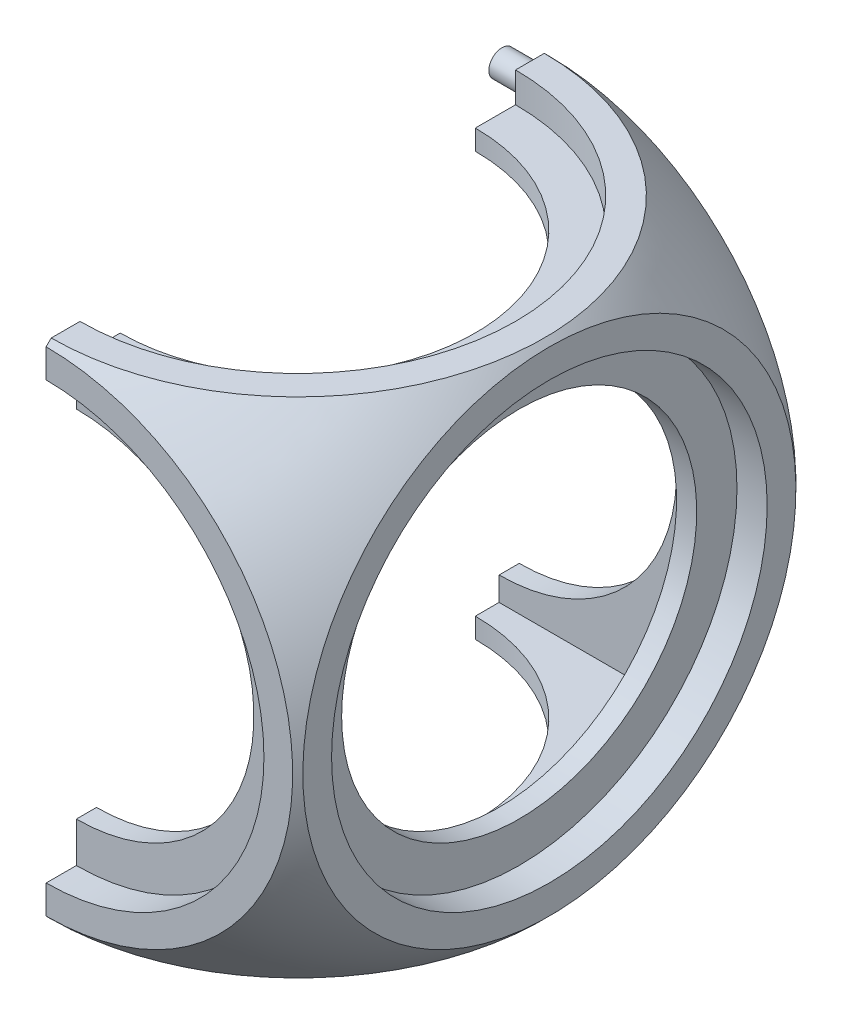
ISO-10303-21;
HEADER;
FILE_DESCRIPTION(('STEP AP214'),'2;1');
FILE_NAME('part.step','',(''),(''),'','','');
FILE_SCHEMA(('AUTOMOTIVE_DESIGN { 1 0 10303 214 1 1 1 1 }'));
ENDSEC;
DATA;
#1=APPLICATION_CONTEXT('core data for automotive mechanical design processes');
#2=APPLICATION_PROTOCOL_DEFINITION('international standard','automotive_design',2000,#1);
#3=PRODUCT_CONTEXT('',#1,'mechanical');
#4=PRODUCT('Part','Part','',(#3));
#5=PRODUCT_RELATED_PRODUCT_CATEGORY('part','',(#4));
#6=PRODUCT_DEFINITION_FORMATION('','',#4);
#7=PRODUCT_DEFINITION_CONTEXT('part definition',#1,'design');
#8=PRODUCT_DEFINITION('design','',#6,#7);
#9=PRODUCT_DEFINITION_SHAPE('','',#8);
#10=(LENGTH_UNIT() NAMED_UNIT(*) SI_UNIT(.MILLI.,.METRE.));
#11=(NAMED_UNIT(*) PLANE_ANGLE_UNIT() SI_UNIT($,.RADIAN.));
#12=(NAMED_UNIT(*) SI_UNIT($,.STERADIAN.) SOLID_ANGLE_UNIT());
#13=UNCERTAINTY_MEASURE_WITH_UNIT(LENGTH_MEASURE(1.E-05),#10,'distance_accuracy_value','');
#14=(GEOMETRIC_REPRESENTATION_CONTEXT(3) GLOBAL_UNCERTAINTY_ASSIGNED_CONTEXT((#13)) GLOBAL_UNIT_ASSIGNED_CONTEXT((#10,
#11,#12)) REPRESENTATION_CONTEXT('',''));
#15=CARTESIAN_POINT('',(0.,0.,0.));
#16=DIRECTION('',(0.,0.,1.));
#17=DIRECTION('',(1.,0.,0.));
#18=AXIS2_PLACEMENT_3D('',#15,#16,#17);
#19=CARTESIAN_POINT('',(0.,2.18217583677695E-13,-62.4999999999998));
#20=DIRECTION('',(0.,0.,1.));
#21=DIRECTION('',(0.,-1.,0.));
#22=AXIS2_PLACEMENT_3D('',#19,#20,#21);
#23=CYLINDRICAL_SURFACE('',#22,44.1);
#24=CARTESIAN_POINT('',(-3.31690727190098E-13,-1.92031473636372E-13,55.));
#25=DIRECTION('',(0.,0.,1.));
#26=DIRECTION('',(-1.,0.,0.));
#27=AXIS2_PLACEMENT_3D('',#24,#25,#26);
#28=CIRCLE('',#27,44.1);
#29=CARTESIAN_POINT('',(0.,-44.1000000000002,54.9999999999999));
#30=VERTEX_POINT('',#29);
#31=CARTESIAN_POINT('',(0.,44.0999999999998,55.0000000000002));
#32=VERTEX_POINT('',#31);
#33=EDGE_CURVE('E312',#30,#32,#28,.T.);
#34=ORIENTED_EDGE('',*,*,#33,.T.);
#35=DIRECTION('',(0.,0.,1.));
#36=VECTOR('',#35,1.);
#37=CARTESIAN_POINT('',(0.,44.1000000000002,-62.4999999999996));
#38=LINE('',#37,#36);
#39=CARTESIAN_POINT('',(0.,44.0999999999998,50.));
#40=VERTEX_POINT('',#39);
#41=EDGE_CURVE('E195',#32,#40,#38,.F.);
#42=ORIENTED_EDGE('',*,*,#41,.T.);
#43=CARTESIAN_POINT('',(0.,-1.74574066942157E-13,50.));
#44=DIRECTION('',(0.,0.,-1.));
#45=DIRECTION('',(-1.,0.,0.));
#46=AXIS2_PLACEMENT_3D('',#43,#44,#45);
#47=CIRCLE('',#46,44.1);
#48=CARTESIAN_POINT('',(0.,-44.1000000000002,50.));
#49=VERTEX_POINT('',#48);
#50=EDGE_CURVE('E250',#40,#49,#47,.T.);
#51=ORIENTED_EDGE('',*,*,#50,.T.);
#52=DIRECTION('',(0.,0.,1.));
#53=VECTOR('',#52,1.);
#54=CARTESIAN_POINT('',(0.,-44.0999999999998,-62.4999999999999));
#55=LINE('',#54,#53);
#56=EDGE_CURVE('E249',#49,#30,#55,.T.);
#57=ORIENTED_EDGE('',*,*,#56,.T.);
#58=EDGE_LOOP('',(#34,#42,#51,#57));
#59=FACE_BOUND('',#58,.T.);
#60=ADVANCED_FACE('F48',(#59),#23,.F.);
#61=CARTESIAN_POINT('',(0.,1.74574066942157E-13,-50.));
#62=DIRECTION('',(0.,0.,1.));
#63=DIRECTION('',(1.,0.,0.));
#64=AXIS2_PLACEMENT_3D('',#61,#62,#63);
#65=CIRCLE('',#64,44.1);
#66=CARTESIAN_POINT('',(0.,-44.0999999999998,-50.));
#67=VERTEX_POINT('',#66);
#68=CARTESIAN_POINT('',(0.,44.1000000000002,-50.));
#69=VERTEX_POINT('',#68);
#70=EDGE_CURVE('E245',#67,#69,#65,.T.);
#71=ORIENTED_EDGE('',*,*,#70,.T.);
#72=DIRECTION('',(0.,0.,1.));
#73=VECTOR('',#72,1.);
#74=CARTESIAN_POINT('',(0.,44.1000000000002,-62.4999999999996));
#75=LINE('',#74,#73);
#76=CARTESIAN_POINT('',(0.,44.1000000000002,-54.9999999999999));
#77=VERTEX_POINT('',#76);
#78=EDGE_CURVE('E248',#69,#77,#75,.F.);
#79=ORIENTED_EDGE('',*,*,#78,.T.);
#80=CARTESIAN_POINT('',(7.15753674462842E-13,1.92031473636372E-13,-55.));
#81=DIRECTION('',(0.,0.,-1.));
#82=DIRECTION('',(1.,0.,0.));
#83=AXIS2_PLACEMENT_3D('',#80,#81,#82);
#84=CIRCLE('',#83,44.1);
#85=CARTESIAN_POINT('',(0.,-44.0999999999998,-55.0000000000002));
#86=VERTEX_POINT('',#85);
#87=EDGE_CURVE('E301',#77,#86,#84,.T.);
#88=ORIENTED_EDGE('',*,*,#87,.T.);
#89=DIRECTION('',(0.,0.,1.));
#90=VECTOR('',#89,1.);
#91=CARTESIAN_POINT('',(0.,-44.0999999999998,-62.4999999999999));
#92=LINE('',#91,#90);
#93=EDGE_CURVE('E304',#86,#67,#92,.T.);
#94=ORIENTED_EDGE('',*,*,#93,.T.);
#95=EDGE_LOOP('',(#71,#79,#88,#94));
#96=FACE_BOUND('',#95,.T.);
#97=ADVANCED_FACE('F474',(#96),#23,.F.);
#98=CARTESIAN_POINT('',(0.,-62.5,0.));
#99=DIRECTION('',(0.,1.,0.));
#100=DIRECTION('',(0.,0.,1.));
#101=AXIS2_PLACEMENT_3D('',#98,#99,#100);
#102=CYLINDRICAL_SURFACE('',#101,44.1);
#103=CARTESIAN_POINT('',(0.,-50.,0.));
#104=DIRECTION('',(0.,1.,0.));
#105=DIRECTION('',(0.,0.,1.));
#106=AXIS2_PLACEMENT_3D('',#103,#104,#105);
#107=CIRCLE('',#106,44.1);
#108=CARTESIAN_POINT('',(0.,-50.,44.1));
#109=VERTEX_POINT('',#108);
#110=CARTESIAN_POINT('',(0.,-50.,-44.1));
#111=VERTEX_POINT('',#110);
#112=EDGE_CURVE('E325',#109,#111,#107,.T.);
#113=ORIENTED_EDGE('',*,*,#112,.T.);
#114=DIRECTION('',(0.,1.,0.));
#115=VECTOR('',#114,1.);
#116=CARTESIAN_POINT('',(0.,-62.5,-44.1));
#117=LINE('',#116,#115);
#118=CARTESIAN_POINT('',(0.,-54.9999999999991,-44.1));
#119=VERTEX_POINT('',#118);
#120=EDGE_CURVE('E292',#111,#119,#117,.F.);
#121=ORIENTED_EDGE('',*,*,#120,.T.);
#122=CARTESIAN_POINT('',(7.15753674462842E-13,-55.,0.));
#123=DIRECTION('',(0.,-1.,0.));
#124=DIRECTION('',(1.,0.,0.));
#125=AXIS2_PLACEMENT_3D('',#122,#123,#124);
#126=CIRCLE('',#125,44.1);
#127=CARTESIAN_POINT('',(0.,-54.9999999999991,44.1));
#128=VERTEX_POINT('',#127);
#129=EDGE_CURVE('E289',#119,#128,#126,.T.);
#130=ORIENTED_EDGE('',*,*,#129,.T.);
#131=DIRECTION('',(0.,1.,0.));
#132=VECTOR('',#131,1.);
#133=CARTESIAN_POINT('',(0.,-62.5,44.1));
#134=LINE('',#133,#132);
#135=EDGE_CURVE('E280',#128,#109,#134,.T.);
#136=ORIENTED_EDGE('',*,*,#135,.T.);
#137=EDGE_LOOP('',(#113,#121,#130,#136));
#138=FACE_BOUND('',#137,.T.);
#139=ADVANCED_FACE('F426',(#138),#102,.F.);
#140=CARTESIAN_POINT('',(-3.31690727190098E-13,55.,0.));
#141=DIRECTION('',(0.,1.,0.));
#142=DIRECTION('',(-1.,0.,0.));
#143=AXIS2_PLACEMENT_3D('',#140,#141,#142);
#144=CIRCLE('',#143,44.1);
#145=CARTESIAN_POINT('',(0.,54.9999999999994,44.1));
#146=VERTEX_POINT('',#145);
#147=CARTESIAN_POINT('',(0.,54.9999999999994,-44.1));
#148=VERTEX_POINT('',#147);
#149=EDGE_CURVE('E277',#146,#148,#144,.T.);
#150=ORIENTED_EDGE('',*,*,#149,.T.);
#151=DIRECTION('',(0.,1.,0.));
#152=VECTOR('',#151,1.);
#153=CARTESIAN_POINT('',(0.,-62.5,-44.1));
#154=LINE('',#153,#152);
#155=CARTESIAN_POINT('',(0.,50.,-44.1));
#156=VERTEX_POINT('',#155);
#157=EDGE_CURVE('E65',#148,#156,#154,.F.);
#158=ORIENTED_EDGE('',*,*,#157,.T.);
#159=CARTESIAN_POINT('',(0.,50.,0.));
#160=DIRECTION('',(0.,1.,0.));
#161=DIRECTION('',(0.,0.,1.));
#162=AXIS2_PLACEMENT_3D('',#159,#160,#161);
#163=CIRCLE('',#162,44.1);
#164=CARTESIAN_POINT('',(0.,50.,44.1));
#165=VERTEX_POINT('',#164);
#166=EDGE_CURVE('E242',#165,#156,#163,.T.);
#167=ORIENTED_EDGE('',*,*,#166,.F.);
#168=DIRECTION('',(0.,1.,0.));
#169=VECTOR('',#168,1.);
#170=CARTESIAN_POINT('',(0.,-62.5,44.1));
#171=LINE('',#170,#169);
#172=EDGE_CURVE('E257',#165,#146,#171,.T.);
#173=ORIENTED_EDGE('',*,*,#172,.T.);
#174=EDGE_LOOP('',(#150,#158,#167,#173));
#175=FACE_BOUND('',#174,.T.);
#176=ADVANCED_FACE('F468',(#175),#102,.F.);
#177=CARTESIAN_POINT('',(87.5000000000002,3.05504617148775E-13,0.));
#178=DIRECTION('',(-1.,0.,0.));
#179=DIRECTION('',(0.,-1.,0.));
#180=AXIS2_PLACEMENT_3D('',#177,#178,#179);
#181=CYLINDRICAL_SURFACE('',#180,44.1);
#182=CARTESIAN_POINT('',(50.,1.74574066942157E-13,0.));
#183=DIRECTION('',(-1.,0.,0.));
#184=DIRECTION('',(0.,0.,1.));
#185=AXIS2_PLACEMENT_3D('',#182,#183,#184);
#186=CIRCLE('',#185,44.1);
#187=CARTESIAN_POINT('',(50.,1.74574066942157E-13,44.1));
#188=VERTEX_POINT('',#187);
#189=EDGE_CURVE('E253',#188,#188,#186,.T.);
#190=ORIENTED_EDGE('',*,*,#189,.T.);
#191=EDGE_LOOP('',(#190));
#192=FACE_BOUND('',#191,.T.);
#193=CARTESIAN_POINT('',(55.,1.39659253553725E-13,0.));
#194=DIRECTION('',(1.,0.,0.));
#195=DIRECTION('',(0.,1.,0.));
#196=AXIS2_PLACEMENT_3D('',#193,#194,#195);
#197=CIRCLE('',#196,44.1);
#198=CARTESIAN_POINT('',(54.9999999999995,44.1000000000001,0.));
#199=VERTEX_POINT('',#198);
#200=EDGE_CURVE('E256',#199,#199,#197,.T.);
#201=ORIENTED_EDGE('',*,*,#200,.T.);
#202=EDGE_LOOP('',(#201));
#203=FACE_BOUND('',#202,.T.);
#204=ADVANCED_FACE('F483',(#192,#203),#181,.F.);
#205=CARTESIAN_POINT('',(50.,50.,-50.));
#206=DIRECTION('',(-1.,0.,0.));
#207=DIRECTION('',(0.,0.,1.));
#208=AXIS2_PLACEMENT_3D('',#205,#206,#207);
#209=PLANE('',#208);
#210=ORIENTED_EDGE('',*,*,#189,.F.);
#211=EDGE_LOOP('',(#210));
#212=FACE_BOUND('',#211,.T.);
#213=DIRECTION('',(0.,-1.,0.));
#214=VECTOR('',#213,1.);
#215=CARTESIAN_POINT('',(50.,50.,50.));
#216=LINE('',#215,#214);
#217=CARTESIAN_POINT('',(50.,50.,50.));
#218=VERTEX_POINT('',#217);
#219=CARTESIAN_POINT('',(50.,-50.,50.));
#220=VERTEX_POINT('',#219);
#221=EDGE_CURVE('E222',#218,#220,#216,.T.);
#222=ORIENTED_EDGE('',*,*,#221,.F.);
#223=DIRECTION('',(0.,0.,-1.));
#224=VECTOR('',#223,1.);
#225=CARTESIAN_POINT('',(50.,50.,-50.));
#226=LINE('',#225,#224);
#227=CARTESIAN_POINT('',(50.,50.,-50.));
#228=VERTEX_POINT('',#227);
#229=EDGE_CURVE('E268',#218,#228,#226,.T.);
#230=ORIENTED_EDGE('',*,*,#229,.T.);
#231=DIRECTION('',(0.,-1.,0.));
#232=VECTOR('',#231,1.);
#233=CARTESIAN_POINT('',(50.,50.,-50.));
#234=LINE('',#233,#232);
#235=CARTESIAN_POINT('',(50.,-50.,-50.));
#236=VERTEX_POINT('',#235);
#237=EDGE_CURVE('E235',#228,#236,#234,.T.);
#238=ORIENTED_EDGE('',*,*,#237,.T.);
#239=DIRECTION('',(0.,0.,-1.));
#240=VECTOR('',#239,1.);
#241=CARTESIAN_POINT('',(50.,-50.,-50.));
#242=LINE('',#241,#240);
#243=EDGE_CURVE('E214',#220,#236,#242,.T.);
#244=ORIENTED_EDGE('',*,*,#243,.F.);
#245=EDGE_LOOP('',(#222,#230,#238,#244));
#246=FACE_BOUND('',#245,.T.);
#247=ADVANCED_FACE('F233',(#212,#246),#209,.T.);
#248=CARTESIAN_POINT('',(-50.,50.,-50.));
#249=DIRECTION('',(0.,0.,1.));
#250=DIRECTION('',(1.,0.,0.));
#251=AXIS2_PLACEMENT_3D('',#248,#249,#250);
#252=PLANE('',#251);
#253=DIRECTION('',(0.,1.,0.));
#254=VECTOR('',#253,1.);
#255=CARTESIAN_POINT('',(0.,50.,-50.));
#256=LINE('',#255,#254);
#257=CARTESIAN_POINT('',(0.,-50.,-50.));
#258=VERTEX_POINT('',#257);
#259=EDGE_CURVE('E328',#258,#67,#256,.T.);
#260=ORIENTED_EDGE('',*,*,#259,.F.);
#261=DIRECTION('',(-1.,0.,0.));
#262=VECTOR('',#261,1.);
#263=CARTESIAN_POINT('',(-50.,-50.,-50.));
#264=LINE('',#263,#262);
#265=EDGE_CURVE('E237',#236,#258,#264,.T.);
#266=ORIENTED_EDGE('',*,*,#265,.F.);
#267=ORIENTED_EDGE('',*,*,#237,.F.);
#268=DIRECTION('',(-1.,0.,0.));
#269=VECTOR('',#268,1.);
#270=CARTESIAN_POINT('',(-50.,50.,-50.));
#271=LINE('',#270,#269);
#272=CARTESIAN_POINT('',(0.,50.,-50.));
#273=VERTEX_POINT('',#272);
#274=EDGE_CURVE('E412',#228,#273,#271,.T.);
#275=ORIENTED_EDGE('',*,*,#274,.T.);
#276=EDGE_CURVE('E332',#69,#273,#256,.T.);
#277=ORIENTED_EDGE('',*,*,#276,.F.);
#278=ORIENTED_EDGE('',*,*,#70,.F.);
#279=EDGE_LOOP('',(#260,#266,#267,#275,#277,#278));
#280=FACE_BOUND('',#279,.T.);
#281=ADVANCED_FACE('F420',(#280),#252,.T.);
#282=CARTESIAN_POINT('',(-50.,50.,50.));
#283=DIRECTION('',(0.,0.,-1.));
#284=DIRECTION('',(-1.,0.,0.));
#285=AXIS2_PLACEMENT_3D('',#282,#283,#284);
#286=PLANE('',#285);
#287=DIRECTION('',(0.,-1.,0.));
#288=VECTOR('',#287,1.);
#289=CARTESIAN_POINT('',(0.,50.,50.));
#290=LINE('',#289,#288);
#291=CARTESIAN_POINT('',(0.,50.,50.));
#292=VERTEX_POINT('',#291);
#293=EDGE_CURVE('E361',#292,#40,#290,.T.);
#294=ORIENTED_EDGE('',*,*,#293,.F.);
#295=DIRECTION('',(1.,0.,0.));
#296=VECTOR('',#295,1.);
#297=CARTESIAN_POINT('',(-50.,50.,50.));
#298=LINE('',#297,#296);
#299=EDGE_CURVE('E226',#292,#218,#298,.T.);
#300=ORIENTED_EDGE('',*,*,#299,.T.);
#301=ORIENTED_EDGE('',*,*,#221,.T.);
#302=DIRECTION('',(1.,0.,0.));
#303=VECTOR('',#302,1.);
#304=CARTESIAN_POINT('',(-50.,-50.,50.));
#305=LINE('',#304,#303);
#306=CARTESIAN_POINT('',(0.,-50.,50.));
#307=VERTEX_POINT('',#306);
#308=EDGE_CURVE('E209',#307,#220,#305,.T.);
#309=ORIENTED_EDGE('',*,*,#308,.F.);
#310=EDGE_CURVE('E351',#49,#307,#290,.T.);
#311=ORIENTED_EDGE('',*,*,#310,.F.);
#312=ORIENTED_EDGE('',*,*,#50,.F.);
#313=EDGE_LOOP('',(#294,#300,#301,#309,#311,#312));
#314=FACE_BOUND('',#313,.T.);
#315=ADVANCED_FACE('F224',(#314),#286,.T.);
#316=CARTESIAN_POINT('',(0.,50.,0.));
#317=DIRECTION('',(0.,1.,0.));
#318=DIRECTION('',(0.,0.,1.));
#319=AXIS2_PLACEMENT_3D('',#316,#317,#318);
#320=PLANE('',#319);
#321=ORIENTED_EDGE('',*,*,#299,.F.);
#322=DIRECTION('',(0.,0.,-1.));
#323=VECTOR('',#322,1.);
#324=CARTESIAN_POINT('',(0.,50.,0.));
#325=LINE('',#324,#323);
#326=EDGE_CURVE('E230',#292,#165,#325,.T.);
#327=ORIENTED_EDGE('',*,*,#326,.T.);
#328=ORIENTED_EDGE('',*,*,#166,.T.);
#329=EDGE_CURVE('E219',#156,#273,#325,.T.);
#330=ORIENTED_EDGE('',*,*,#329,.T.);
#331=ORIENTED_EDGE('',*,*,#274,.F.);
#332=ORIENTED_EDGE('',*,*,#229,.F.);
#333=EDGE_LOOP('',(#321,#327,#328,#330,#331,#332));
#334=FACE_BOUND('',#333,.T.);
#335=ADVANCED_FACE('F470',(#334),#320,.F.);
#336=CARTESIAN_POINT('',(0.,-50.,0.));
#337=DIRECTION('',(0.,1.,0.));
#338=DIRECTION('',(0.,0.,1.));
#339=AXIS2_PLACEMENT_3D('',#336,#337,#338);
#340=PLANE('',#339);
#341=DIRECTION('',(0.,0.,-1.));
#342=VECTOR('',#341,1.);
#343=CARTESIAN_POINT('',(0.,-50.,0.));
#344=LINE('',#343,#342);
#345=EDGE_CURVE('E216',#307,#109,#344,.T.);
#346=ORIENTED_EDGE('',*,*,#345,.F.);
#347=ORIENTED_EDGE('',*,*,#308,.T.);
#348=ORIENTED_EDGE('',*,*,#243,.T.);
#349=ORIENTED_EDGE('',*,*,#265,.T.);
#350=EDGE_CURVE('E331',#111,#258,#344,.T.);
#351=ORIENTED_EDGE('',*,*,#350,.F.);
#352=ORIENTED_EDGE('',*,*,#112,.F.);
#353=EDGE_LOOP('',(#346,#347,#348,#349,#351,#352));
#354=FACE_BOUND('',#353,.T.);
#355=ADVANCED_FACE('F211',(#354),#340,.T.);
#356=CARTESIAN_POINT('',(0.,0.,0.));
#357=DIRECTION('',(0.,1.,0.));
#358=DIRECTION('',(1.,0.,0.));
#359=AXIS2_PLACEMENT_3D('',#356,#357,#358);
#360=SPHERICAL_SURFACE('',#359,87.5);
#361=CARTESIAN_POINT('',(0.,6.54652751033088E-13,-62.5));
#362=DIRECTION('',(0.,0.,-1.));
#363=DIRECTION('',(0.,1.,0.));
#364=AXIS2_PLACEMENT_3D('',#361,#362,#363);
#365=CIRCLE('',#364,61.2372435695794);
#366=CARTESIAN_POINT('',(0.,61.2372435695801,-62.4999999999994));
#367=VERTEX_POINT('',#366);
#368=CARTESIAN_POINT('',(0.,-61.2372435695788,-62.5000000000006));
#369=VERTEX_POINT('',#368);
#370=EDGE_CURVE('E402',#367,#369,#365,.T.);
#371=ORIENTED_EDGE('',*,*,#370,.F.);
#372=CARTESIAN_POINT('',(0.,0.,0.));
#373=DIRECTION('',(1.,0.,0.));
#374=DIRECTION('',(0.,0.,-1.));
#375=AXIS2_PLACEMENT_3D('',#372,#373,#374);
#376=CIRCLE('',#375,87.5);
#377=CARTESIAN_POINT('',(0.,62.5,-61.2372435695794));
#378=VERTEX_POINT('',#377);
#379=EDGE_CURVE('E239',#367,#378,#376,.T.);
#380=ORIENTED_EDGE('',*,*,#379,.T.);
#381=CARTESIAN_POINT('',(0.,62.5,0.));
#382=DIRECTION('',(0.,1.,0.));
#383=DIRECTION('',(0.,0.,1.));
#384=AXIS2_PLACEMENT_3D('',#381,#382,#383);
#385=CIRCLE('',#384,61.2372435695794);
#386=CARTESIAN_POINT('',(0.,62.5,61.2372435695794));
#387=VERTEX_POINT('',#386);
#388=EDGE_CURVE('E408',#387,#378,#385,.T.);
#389=ORIENTED_EDGE('',*,*,#388,.F.);
#390=CARTESIAN_POINT('',(0.,61.2372435695792,62.5000000000002));
#391=VERTEX_POINT('',#390);
#392=EDGE_CURVE('E374',#387,#391,#376,.T.);
#393=ORIENTED_EDGE('',*,*,#392,.T.);
#394=CARTESIAN_POINT('',(0.,-2.18217583677696E-13,62.5));
#395=DIRECTION('',(0.,0.,1.));
#396=DIRECTION('',(0.,-1.,0.));
#397=AXIS2_PLACEMENT_3D('',#394,#395,#396);
#398=CIRCLE('',#397,61.2372435695794);
#399=CARTESIAN_POINT('',(0.,-61.2372435695797,62.4999999999998));
#400=VERTEX_POINT('',#399);
#401=EDGE_CURVE('E399',#400,#391,#398,.T.);
#402=ORIENTED_EDGE('',*,*,#401,.F.);
#403=CARTESIAN_POINT('',(0.,-62.5,61.2372435695794));
#404=VERTEX_POINT('',#403);
#405=EDGE_CURVE('E377',#400,#404,#376,.T.);
#406=ORIENTED_EDGE('',*,*,#405,.T.);
#407=CARTESIAN_POINT('',(0.,-62.5,0.));
#408=DIRECTION('',(0.,-1.,0.));
#409=DIRECTION('',(0.,0.,-1.));
#410=AXIS2_PLACEMENT_3D('',#407,#408,#409);
#411=CIRCLE('',#410,61.2372435695794);
#412=CARTESIAN_POINT('',(0.,-62.5,-61.2372435695794));
#413=VERTEX_POINT('',#412);
#414=EDGE_CURVE('E405',#413,#404,#411,.T.);
#415=ORIENTED_EDGE('',*,*,#414,.F.);
#416=EDGE_CURVE('E411',#413,#369,#376,.T.);
#417=ORIENTED_EDGE('',*,*,#416,.T.);
#418=EDGE_LOOP('',(#371,#380,#389,#393,#402,#406,#415,#417));
#419=FACE_BOUND('',#418,.T.);
#420=CARTESIAN_POINT('',(62.5,6.54652751033088E-13,0.));
#421=DIRECTION('',(1.,0.,0.));
#422=DIRECTION('',(0.,1.,0.));
#423=AXIS2_PLACEMENT_3D('',#420,#421,#422);
#424=CIRCLE('',#423,61.2372435695794);
#425=CARTESIAN_POINT('',(62.4999999999994,61.2372435695801,0.));
#426=VERTEX_POINT('',#425);
#427=EDGE_CURVE('E262',#426,#426,#424,.T.);
#428=ORIENTED_EDGE('',*,*,#427,.F.);
#429=EDGE_LOOP('',(#428));
#430=FACE_BOUND('',#429,.T.);
#431=ADVANCED_FACE('F446',(#419,#430),#360,.T.);
#432=CARTESIAN_POINT('',(0.,62.5,0.));
#433=DIRECTION('',(0.,1.,0.));
#434=DIRECTION('',(0.,0.,1.));
#435=AXIS2_PLACEMENT_3D('',#432,#433,#434);
#436=PLANE('',#435);
#437=DIRECTION('',(0.,0.,-1.));
#438=VECTOR('',#437,1.);
#439=CARTESIAN_POINT('',(0.,62.5,0.));
#440=LINE('',#439,#438);
#441=CARTESIAN_POINT('',(0.,62.5,54.1));
#442=VERTEX_POINT('',#441);
#443=EDGE_CURVE('E346',#387,#442,#440,.T.);
#444=ORIENTED_EDGE('',*,*,#443,.F.);
#445=ORIENTED_EDGE('',*,*,#388,.T.);
#446=CARTESIAN_POINT('',(0.,62.5,-54.1));
#447=VERTEX_POINT('',#446);
#448=EDGE_CURVE('E372',#447,#378,#440,.T.);
#449=ORIENTED_EDGE('',*,*,#448,.F.);
#450=CARTESIAN_POINT('',(-4.36435167355392E-13,62.5,0.));
#451=DIRECTION('',(0.,1.,0.));
#452=DIRECTION('',(-1.,0.,0.));
#453=AXIS2_PLACEMENT_3D('',#450,#451,#452);
#454=CIRCLE('',#453,54.1);
#455=EDGE_CURVE('E265',#442,#447,#454,.T.);
#456=ORIENTED_EDGE('',*,*,#455,.F.);
#457=EDGE_LOOP('',(#444,#445,#449,#456));
#458=FACE_BOUND('',#457,.T.);
#459=ADVANCED_FACE('F456',(#458),#436,.T.);
#460=CARTESIAN_POINT('',(0.,-62.5,0.));
#461=DIRECTION('',(0.,-1.,0.));
#462=DIRECTION('',(0.,0.,-1.));
#463=AXIS2_PLACEMENT_3D('',#460,#461,#462);
#464=PLANE('',#463);
#465=DIRECTION('',(0.,0.,1.));
#466=VECTOR('',#465,1.);
#467=CARTESIAN_POINT('',(0.,-62.5,0.));
#468=LINE('',#467,#466);
#469=CARTESIAN_POINT('',(0.,-62.5,-54.1));
#470=VERTEX_POINT('',#469);
#471=EDGE_CURVE('E337',#413,#470,#468,.T.);
#472=ORIENTED_EDGE('',*,*,#471,.F.);
#473=ORIENTED_EDGE('',*,*,#414,.T.);
#474=CARTESIAN_POINT('',(0.,-62.5,54.1));
#475=VERTEX_POINT('',#474);
#476=EDGE_CURVE('E345',#475,#404,#468,.T.);
#477=ORIENTED_EDGE('',*,*,#476,.F.);
#478=CARTESIAN_POINT('',(8.72870334710783E-13,-62.5,0.));
#479=DIRECTION('',(0.,-1.,0.));
#480=DIRECTION('',(1.,0.,0.));
#481=AXIS2_PLACEMENT_3D('',#478,#479,#480);
#482=CIRCLE('',#481,54.1);
#483=EDGE_CURVE('E275',#470,#475,#482,.T.);
#484=ORIENTED_EDGE('',*,*,#483,.F.);
#485=EDGE_LOOP('',(#472,#473,#477,#484));
#486=FACE_BOUND('',#485,.T.);
#487=ADVANCED_FACE('F441',(#486),#464,.T.);
#488=CARTESIAN_POINT('',(0.,6.54652751033088E-13,-62.5));
#489=DIRECTION('',(0.,0.,-1.));
#490=DIRECTION('',(0.,1.,0.));
#491=AXIS2_PLACEMENT_3D('',#488,#489,#490);
#492=PLANE('',#491);
#493=DIRECTION('',(0.,-1.,0.));
#494=VECTOR('',#493,1.);
#495=CARTESIAN_POINT('',(0.,6.54652751033088E-13,-62.5));
#496=LINE('',#495,#494);
#497=CARTESIAN_POINT('',(1.57116660247921E-13,54.1000000000002,-62.4999999999989));
#498=VERTEX_POINT('',#497);
#499=EDGE_CURVE('E338',#367,#498,#496,.T.);
#500=ORIENTED_EDGE('',*,*,#499,.F.);
#501=ORIENTED_EDGE('',*,*,#370,.T.);
#502=CARTESIAN_POINT('',(1.57116660247913E-13,-54.0999999999998,-62.4999999999989));
#503=VERTEX_POINT('',#502);
#504=EDGE_CURVE('E335',#503,#369,#496,.T.);
#505=ORIENTED_EDGE('',*,*,#504,.F.);
#506=CARTESIAN_POINT('',(8.72870334710783E-13,2.18217583677696E-13,-62.5));
#507=DIRECTION('',(0.,0.,-1.));
#508=DIRECTION('',(1.,0.,0.));
#509=AXIS2_PLACEMENT_3D('',#506,#507,#508);
#510=CIRCLE('',#509,54.1);
#511=EDGE_CURVE('E287',#498,#503,#510,.T.);
#512=ORIENTED_EDGE('',*,*,#511,.F.);
#513=EDGE_LOOP('',(#500,#501,#505,#512));
#514=FACE_BOUND('',#513,.T.);
#515=ADVANCED_FACE('F538',(#514),#492,.T.);
#516=CARTESIAN_POINT('',(0.,-2.18217583677696E-13,62.5));
#517=DIRECTION('',(0.,0.,1.));
#518=DIRECTION('',(0.,-1.,0.));
#519=AXIS2_PLACEMENT_3D('',#516,#517,#518);
#520=PLANE('',#519);
#521=DIRECTION('',(0.,1.,0.));
#522=VECTOR('',#521,1.);
#523=CARTESIAN_POINT('',(0.,-2.18217583677696E-13,62.5));
#524=LINE('',#523,#522);
#525=CARTESIAN_POINT('',(-1.04744440165286E-13,-54.1000000000002,62.4999999999992));
#526=VERTEX_POINT('',#525);
#527=EDGE_CURVE('E355',#400,#526,#524,.T.);
#528=ORIENTED_EDGE('',*,*,#527,.F.);
#529=ORIENTED_EDGE('',*,*,#401,.T.);
#530=CARTESIAN_POINT('',(-1.04744440165281E-13,54.0999999999998,62.4999999999992));
#531=VERTEX_POINT('',#530);
#532=EDGE_CURVE('E371',#531,#391,#524,.T.);
#533=ORIENTED_EDGE('',*,*,#532,.F.);
#534=CARTESIAN_POINT('',(-4.36435167355392E-13,-2.18217583677696E-13,62.5));
#535=DIRECTION('',(0.,0.,1.));
#536=DIRECTION('',(-1.,0.,0.));
#537=AXIS2_PLACEMENT_3D('',#534,#535,#536);
#538=CIRCLE('',#537,54.1);
#539=EDGE_CURVE('E299',#526,#531,#538,.T.);
#540=ORIENTED_EDGE('',*,*,#539,.F.);
#541=EDGE_LOOP('',(#528,#529,#533,#540));
#542=FACE_BOUND('',#541,.T.);
#543=ADVANCED_FACE('F545',(#542),#520,.T.);
#544=CARTESIAN_POINT('',(62.5,6.54652751033088E-13,0.));
#545=DIRECTION('',(1.,0.,0.));
#546=DIRECTION('',(0.,0.,1.));
#547=AXIS2_PLACEMENT_3D('',#544,#545,#546);
#548=PLANE('',#547);
#549=CARTESIAN_POINT('',(62.5,2.18217583677696E-13,0.));
#550=DIRECTION('',(1.,0.,0.));
#551=DIRECTION('',(0.,1.,0.));
#552=AXIS2_PLACEMENT_3D('',#549,#550,#551);
#553=CIRCLE('',#552,54.1);
#554=CARTESIAN_POINT('',(62.4999999999994,54.1000000000002,0.));
#555=VERTEX_POINT('',#554);
#556=EDGE_CURVE('E258',#555,#555,#553,.T.);
#557=ORIENTED_EDGE('',*,*,#556,.F.);
#558=EDGE_LOOP('',(#557));
#559=FACE_BOUND('',#558,.T.);
#560=ORIENTED_EDGE('',*,*,#427,.T.);
#561=EDGE_LOOP('',(#560));
#562=FACE_BOUND('',#561,.T.);
#563=ADVANCED_FACE('F491',(#559,#562),#548,.T.);
#564=CARTESIAN_POINT('',(55.,1.39659253553725E-13,0.));
#565=DIRECTION('',(1.,0.,0.));
#566=DIRECTION('',(0.,1.,0.));
#567=AXIS2_PLACEMENT_3D('',#564,#565,#566);
#568=CYLINDRICAL_SURFACE('',#567,54.1);
#569=CARTESIAN_POINT('',(55.,1.39659253553725E-13,0.));
#570=DIRECTION('',(1.,0.,0.));
#571=DIRECTION('',(0.,1.,0.));
#572=AXIS2_PLACEMENT_3D('',#569,#570,#571);
#573=CIRCLE('',#572,54.1);
#574=CARTESIAN_POINT('',(54.9999999999994,54.1000000000002,0.));
#575=VERTEX_POINT('',#574);
#576=EDGE_CURVE('E261',#575,#575,#573,.T.);
#577=ORIENTED_EDGE('',*,*,#576,.F.);
#578=EDGE_LOOP('',(#577));
#579=FACE_BOUND('',#578,.T.);
#580=ORIENTED_EDGE('',*,*,#556,.T.);
#581=EDGE_LOOP('',(#580));
#582=FACE_BOUND('',#581,.T.);
#583=ADVANCED_FACE('F487',(#579,#582),#568,.F.);
#584=CARTESIAN_POINT('',(55.,1.39659253553725E-13,0.));
#585=DIRECTION('',(1.,0.,0.));
#586=DIRECTION('',(0.,1.,0.));
#587=AXIS2_PLACEMENT_3D('',#584,#585,#586);
#588=PLANE('',#587);
#589=ORIENTED_EDGE('',*,*,#200,.F.);
#590=EDGE_LOOP('',(#589));
#591=FACE_BOUND('',#590,.T.);
#592=ORIENTED_EDGE('',*,*,#576,.T.);
#593=EDGE_LOOP('',(#592));
#594=FACE_BOUND('',#593,.T.);
#595=ADVANCED_FACE('F490',(#591,#594),#588,.T.);
#596=CARTESIAN_POINT('',(-3.31690727190098E-13,55.,0.));
#597=DIRECTION('',(0.,1.,0.));
#598=DIRECTION('',(-1.,0.,0.));
#599=AXIS2_PLACEMENT_3D('',#596,#597,#598);
#600=CYLINDRICAL_SURFACE('',#599,54.1);
#601=ORIENTED_EDGE('',*,*,#455,.T.);
#602=DIRECTION('',(0.,1.,0.));
#603=VECTOR('',#602,1.);
#604=CARTESIAN_POINT('',(0.,55.,-54.1));
#605=LINE('',#604,#603);
#606=CARTESIAN_POINT('',(0.,54.9999999999992,-54.1));
#607=VERTEX_POINT('',#606);
#608=EDGE_CURVE('E271',#447,#607,#605,.F.);
#609=ORIENTED_EDGE('',*,*,#608,.T.);
#610=CARTESIAN_POINT('',(-3.31690727190098E-13,55.,0.));
#611=DIRECTION('',(0.,1.,0.));
#612=DIRECTION('',(-1.,0.,0.));
#613=AXIS2_PLACEMENT_3D('',#610,#611,#612);
#614=CIRCLE('',#613,54.1);
#615=CARTESIAN_POINT('',(0.,54.9999999999992,54.1));
#616=VERTEX_POINT('',#615);
#617=EDGE_CURVE('E272',#616,#607,#614,.T.);
#618=ORIENTED_EDGE('',*,*,#617,.F.);
#619=DIRECTION('',(0.,1.,0.));
#620=VECTOR('',#619,1.);
#621=CARTESIAN_POINT('',(0.,55.,54.1));
#622=LINE('',#621,#620);
#623=EDGE_CURVE('E276',#616,#442,#622,.T.);
#624=ORIENTED_EDGE('',*,*,#623,.T.);
#625=EDGE_LOOP('',(#601,#609,#618,#624));
#626=FACE_BOUND('',#625,.T.);
#627=ADVANCED_FACE('F462',(#626),#600,.F.);
#628=CARTESIAN_POINT('',(-3.31690727190098E-13,55.,0.));
#629=DIRECTION('',(0.,1.,0.));
#630=DIRECTION('',(-1.,0.,0.));
#631=AXIS2_PLACEMENT_3D('',#628,#629,#630);
#632=PLANE('',#631);
#633=DIRECTION('',(0.,0.,-1.));
#634=VECTOR('',#633,1.);
#635=CARTESIAN_POINT('',(0.,55.,0.));
#636=LINE('',#635,#634);
#637=EDGE_CURVE('E310',#616,#146,#636,.T.);
#638=ORIENTED_EDGE('',*,*,#637,.F.);
#639=ORIENTED_EDGE('',*,*,#617,.T.);
#640=EDGE_CURVE('E362',#148,#607,#636,.T.);
#641=ORIENTED_EDGE('',*,*,#640,.F.);
#642=ORIENTED_EDGE('',*,*,#149,.F.);
#643=EDGE_LOOP('',(#638,#639,#641,#642));
#644=FACE_BOUND('',#643,.T.);
#645=ADVANCED_FACE('F464',(#644),#632,.T.);
#646=CARTESIAN_POINT('',(7.15753674462842E-13,-55.,0.));
#647=DIRECTION('',(0.,-1.,0.));
#648=DIRECTION('',(1.,0.,0.));
#649=AXIS2_PLACEMENT_3D('',#646,#647,#648);
#650=CYLINDRICAL_SURFACE('',#649,54.1);
#651=ORIENTED_EDGE('',*,*,#483,.T.);
#652=DIRECTION('',(0.,-1.,0.));
#653=VECTOR('',#652,1.);
#654=CARTESIAN_POINT('',(0.,-55.,54.1));
#655=LINE('',#654,#653);
#656=CARTESIAN_POINT('',(0.,-54.9999999999989,54.1));
#657=VERTEX_POINT('',#656);
#658=EDGE_CURVE('E283',#475,#657,#655,.F.);
#659=ORIENTED_EDGE('',*,*,#658,.T.);
#660=CARTESIAN_POINT('',(7.15753674462842E-13,-55.,0.));
#661=DIRECTION('',(0.,-1.,0.));
#662=DIRECTION('',(1.,0.,0.));
#663=AXIS2_PLACEMENT_3D('',#660,#661,#662);
#664=CIRCLE('',#663,54.1);
#665=CARTESIAN_POINT('',(0.,-54.9999999999989,-54.1));
#666=VERTEX_POINT('',#665);
#667=EDGE_CURVE('E284',#666,#657,#664,.T.);
#668=ORIENTED_EDGE('',*,*,#667,.F.);
#669=DIRECTION('',(0.,-1.,0.));
#670=VECTOR('',#669,1.);
#671=CARTESIAN_POINT('',(0.,-55.,-54.1));
#672=LINE('',#671,#670);
#673=EDGE_CURVE('E288',#666,#470,#672,.T.);
#674=ORIENTED_EDGE('',*,*,#673,.T.);
#675=EDGE_LOOP('',(#651,#659,#668,#674));
#676=FACE_BOUND('',#675,.T.);
#677=ADVANCED_FACE('F435',(#676),#650,.F.);
#678=CARTESIAN_POINT('',(7.15753674462842E-13,-55.,0.));
#679=DIRECTION('',(0.,-1.,0.));
#680=DIRECTION('',(1.,0.,0.));
#681=AXIS2_PLACEMENT_3D('',#678,#679,#680);
#682=PLANE('',#681);
#683=DIRECTION('',(0.,0.,1.));
#684=VECTOR('',#683,1.);
#685=CARTESIAN_POINT('',(0.,-55.,0.));
#686=LINE('',#685,#684);
#687=EDGE_CURVE('E347',#666,#119,#686,.T.);
#688=ORIENTED_EDGE('',*,*,#687,.F.);
#689=ORIENTED_EDGE('',*,*,#667,.T.);
#690=EDGE_CURVE('E343',#128,#657,#686,.T.);
#691=ORIENTED_EDGE('',*,*,#690,.F.);
#692=ORIENTED_EDGE('',*,*,#129,.F.);
#693=EDGE_LOOP('',(#688,#689,#691,#692));
#694=FACE_BOUND('',#693,.T.);
#695=ADVANCED_FACE('F432',(#694),#682,.T.);
#696=CARTESIAN_POINT('',(7.15753674462842E-13,1.92031473636372E-13,-55.));
#697=DIRECTION('',(0.,0.,-1.));
#698=DIRECTION('',(-1.,0.,0.));
#699=AXIS2_PLACEMENT_3D('',#696,#697,#698);
#700=CYLINDRICAL_SURFACE('',#699,54.1);
#701=ORIENTED_EDGE('',*,*,#511,.T.);
#702=DIRECTION('',(0.,0.,-1.));
#703=VECTOR('',#702,1.);
#704=CARTESIAN_POINT('',(0.,-54.0999999999998,-55.0000000000002));
#705=LINE('',#704,#703);
#706=CARTESIAN_POINT('',(0.,-54.0999999999998,-55.0000000000002));
#707=VERTEX_POINT('',#706);
#708=EDGE_CURVE('E295',#503,#707,#705,.F.);
#709=ORIENTED_EDGE('',*,*,#708,.T.);
#710=CARTESIAN_POINT('',(7.15753674462842E-13,1.92031473636372E-13,-55.));
#711=DIRECTION('',(0.,0.,-1.));
#712=DIRECTION('',(1.,0.,0.));
#713=AXIS2_PLACEMENT_3D('',#710,#711,#712);
#714=CIRCLE('',#713,54.1);
#715=CARTESIAN_POINT('',(0.,54.1000000000002,-54.9999999999998));
#716=VERTEX_POINT('',#715);
#717=EDGE_CURVE('E296',#716,#707,#714,.T.);
#718=ORIENTED_EDGE('',*,*,#717,.F.);
#719=DIRECTION('',(0.,0.,-1.));
#720=VECTOR('',#719,1.);
#721=CARTESIAN_POINT('',(0.,54.1000000000002,-54.9999999999998));
#722=LINE('',#721,#720);
#723=EDGE_CURVE('E300',#716,#498,#722,.T.);
#724=ORIENTED_EDGE('',*,*,#723,.T.);
#725=EDGE_LOOP('',(#701,#709,#718,#724));
#726=FACE_BOUND('',#725,.T.);
#727=ADVANCED_FACE('F504',(#726),#700,.F.);
#728=CARTESIAN_POINT('',(7.15753674462842E-13,1.92031473636372E-13,-55.));
#729=DIRECTION('',(0.,0.,-1.));
#730=DIRECTION('',(1.,0.,0.));
#731=AXIS2_PLACEMENT_3D('',#728,#729,#730);
#732=PLANE('',#731);
#733=DIRECTION('',(0.,-1.,0.));
#734=VECTOR('',#733,1.);
#735=CARTESIAN_POINT('',(0.,1.92031473636372E-13,-55.));
#736=LINE('',#735,#734);
#737=EDGE_CURVE('E342',#716,#77,#736,.T.);
#738=ORIENTED_EDGE('',*,*,#737,.F.);
#739=ORIENTED_EDGE('',*,*,#717,.T.);
#740=EDGE_CURVE('E330',#86,#707,#736,.T.);
#741=ORIENTED_EDGE('',*,*,#740,.F.);
#742=ORIENTED_EDGE('',*,*,#87,.F.);
#743=EDGE_LOOP('',(#738,#739,#741,#742));
#744=FACE_BOUND('',#743,.T.);
#745=ADVANCED_FACE('F507',(#744),#732,.T.);
#746=CARTESIAN_POINT('',(-3.31690727190098E-13,-1.92031473636372E-13,55.));
#747=DIRECTION('',(0.,0.,1.));
#748=DIRECTION('',(1.,0.,0.));
#749=AXIS2_PLACEMENT_3D('',#746,#747,#748);
#750=CYLINDRICAL_SURFACE('',#749,54.1);
#751=ORIENTED_EDGE('',*,*,#539,.T.);
#752=DIRECTION('',(0.,0.,1.));
#753=VECTOR('',#752,1.);
#754=CARTESIAN_POINT('',(0.,54.0999999999998,55.0000000000002));
#755=LINE('',#754,#753);
#756=CARTESIAN_POINT('',(0.,54.0999999999998,55.0000000000002));
#757=VERTEX_POINT('',#756);
#758=EDGE_CURVE('E188',#531,#757,#755,.F.);
#759=ORIENTED_EDGE('',*,*,#758,.T.);
#760=CARTESIAN_POINT('',(-3.31690727190098E-13,-1.92031473636372E-13,55.));
#761=DIRECTION('',(0.,0.,1.));
#762=DIRECTION('',(-1.,0.,0.));
#763=AXIS2_PLACEMENT_3D('',#760,#761,#762);
#764=CIRCLE('',#763,54.1);
#765=CARTESIAN_POINT('',(0.,-54.1000000000002,54.9999999999998));
#766=VERTEX_POINT('',#765);
#767=EDGE_CURVE('E307',#766,#757,#764,.T.);
#768=ORIENTED_EDGE('',*,*,#767,.F.);
#769=DIRECTION('',(0.,0.,1.));
#770=VECTOR('',#769,1.);
#771=CARTESIAN_POINT('',(0.,-54.1000000000002,54.9999999999998));
#772=LINE('',#771,#770);
#773=EDGE_CURVE('E311',#766,#526,#772,.T.);
#774=ORIENTED_EDGE('',*,*,#773,.T.);
#775=EDGE_LOOP('',(#751,#759,#768,#774));
#776=FACE_BOUND('',#775,.T.);
#777=ADVANCED_FACE('F381',(#776),#750,.F.);
#778=CARTESIAN_POINT('',(-3.31690727190098E-13,-1.92031473636372E-13,55.));
#779=DIRECTION('',(0.,0.,1.));
#780=DIRECTION('',(-1.,0.,0.));
#781=AXIS2_PLACEMENT_3D('',#778,#779,#780);
#782=PLANE('',#781);
#783=DIRECTION('',(0.,1.,0.));
#784=VECTOR('',#783,1.);
#785=CARTESIAN_POINT('',(0.,-1.92031473636372E-13,55.));
#786=LINE('',#785,#784);
#787=EDGE_CURVE('E387',#766,#30,#786,.T.);
#788=ORIENTED_EDGE('',*,*,#787,.F.);
#789=ORIENTED_EDGE('',*,*,#767,.T.);
#790=EDGE_CURVE('E192',#32,#757,#786,.T.);
#791=ORIENTED_EDGE('',*,*,#790,.F.);
#792=ORIENTED_EDGE('',*,*,#33,.F.);
#793=EDGE_LOOP('',(#788,#789,#791,#792));
#794=FACE_BOUND('',#793,.T.);
#795=ADVANCED_FACE('F385',(#794),#782,.T.);
#796=CARTESIAN_POINT('',(0.,0.,0.));
#797=DIRECTION('',(1.,0.,0.));
#798=DIRECTION('',(0.,0.,-1.));
#799=AXIS2_PLACEMENT_3D('',#796,#797,#798);
#800=PLANE('',#799);
#801=ORIENTED_EDGE('',*,*,#637,.T.);
#802=ORIENTED_EDGE('',*,*,#172,.F.);
#803=ORIENTED_EDGE('',*,*,#326,.F.);
#804=ORIENTED_EDGE('',*,*,#293,.T.);
#805=ORIENTED_EDGE('',*,*,#41,.F.);
#806=ORIENTED_EDGE('',*,*,#790,.T.);
#807=ORIENTED_EDGE('',*,*,#758,.F.);
#808=ORIENTED_EDGE('',*,*,#532,.T.);
#809=ORIENTED_EDGE('',*,*,#392,.F.);
#810=ORIENTED_EDGE('',*,*,#443,.T.);
#811=ORIENTED_EDGE('',*,*,#623,.F.);
#812=EDGE_LOOP('',(#801,#802,#803,#804,#805,#806,#807,#808,#809,#810,#811));
#813=FACE_BOUND('',#812,.T.);
#814=ADVANCED_FACE('F458',(#813),#800,.F.);
#815=CARTESIAN_POINT('',(0.,-58.2109216769101,58.2109216769126));
#816=DIRECTION('',(-1.,0.,0.));
#817=DIRECTION('',(0.,0.,-1.));
#818=AXIS2_PLACEMENT_3D('',#815,#816,#817);
#819=CIRCLE('',#818,3.5);
#820=CARTESIAN_POINT('',(0.,-58.2109216769101,54.7109216769126));
#821=VERTEX_POINT('',#820);
#822=EDGE_CURVE('E393',#821,#821,#819,.T.);
#823=ORIENTED_EDGE('',*,*,#822,.F.);
#824=EDGE_LOOP('',(#823));
#825=FACE_BOUND('',#824,.T.);
#826=ORIENTED_EDGE('',*,*,#690,.T.);
#827=ORIENTED_EDGE('',*,*,#658,.F.);
#828=ORIENTED_EDGE('',*,*,#476,.T.);
#829=ORIENTED_EDGE('',*,*,#405,.F.);
#830=ORIENTED_EDGE('',*,*,#527,.T.);
#831=ORIENTED_EDGE('',*,*,#773,.F.);
#832=ORIENTED_EDGE('',*,*,#787,.T.);
#833=ORIENTED_EDGE('',*,*,#56,.F.);
#834=ORIENTED_EDGE('',*,*,#310,.T.);
#835=ORIENTED_EDGE('',*,*,#345,.T.);
#836=ORIENTED_EDGE('',*,*,#135,.F.);
#837=EDGE_LOOP('',(#826,#827,#828,#829,#830,#831,#832,#833,#834,#835,#836));
#838=FACE_BOUND('',#837,.T.);
#839=ADVANCED_FACE('F429',(#825,#838),#800,.F.);
#840=ORIENTED_EDGE('',*,*,#687,.T.);
#841=ORIENTED_EDGE('',*,*,#120,.F.);
#842=ORIENTED_EDGE('',*,*,#350,.T.);
#843=ORIENTED_EDGE('',*,*,#259,.T.);
#844=ORIENTED_EDGE('',*,*,#93,.F.);
#845=ORIENTED_EDGE('',*,*,#740,.T.);
#846=ORIENTED_EDGE('',*,*,#708,.F.);
#847=ORIENTED_EDGE('',*,*,#504,.T.);
#848=ORIENTED_EDGE('',*,*,#416,.F.);
#849=ORIENTED_EDGE('',*,*,#471,.T.);
#850=ORIENTED_EDGE('',*,*,#673,.F.);
#851=EDGE_LOOP('',(#840,#841,#842,#843,#844,#845,#846,#847,#848,#849,#850));
#852=FACE_BOUND('',#851,.T.);
#853=ADVANCED_FACE('F527',(#852),#800,.F.);
#854=CARTESIAN_POINT('',(0.,58.2109216769128,-58.2109216769099));
#855=DIRECTION('',(-1.,0.,0.));
#856=DIRECTION('',(0.,0.,1.));
#857=AXIS2_PLACEMENT_3D('',#854,#855,#856);
#858=CIRCLE('',#857,3.25);
#859=CARTESIAN_POINT('',(0.,58.2109216769128,-54.9609216769099));
#860=VERTEX_POINT('',#859);
#861=EDGE_CURVE('E52',#860,#860,#858,.T.);
#862=ORIENTED_EDGE('',*,*,#861,.F.);
#863=EDGE_LOOP('',(#862));
#864=FACE_BOUND('',#863,.T.);
#865=ORIENTED_EDGE('',*,*,#640,.T.);
#866=ORIENTED_EDGE('',*,*,#608,.F.);
#867=ORIENTED_EDGE('',*,*,#448,.T.);
#868=ORIENTED_EDGE('',*,*,#379,.F.);
#869=ORIENTED_EDGE('',*,*,#499,.T.);
#870=ORIENTED_EDGE('',*,*,#723,.F.);
#871=ORIENTED_EDGE('',*,*,#737,.T.);
#872=ORIENTED_EDGE('',*,*,#78,.F.);
#873=ORIENTED_EDGE('',*,*,#276,.T.);
#874=ORIENTED_EDGE('',*,*,#329,.F.);
#875=ORIENTED_EDGE('',*,*,#157,.F.);
#876=EDGE_LOOP('',(#865,#866,#867,#868,#869,#870,#871,#872,#873,#874,#875));
#877=FACE_BOUND('',#876,.T.);
#878=ADVANCED_FACE('F517',(#864,#877),#800,.F.);
#879=CARTESIAN_POINT('',(8.5,58.2109216769128,-58.2109216769099));
#880=DIRECTION('',(-1.,0.,0.));
#881=DIRECTION('',(0.,0.,1.));
#882=AXIS2_PLACEMENT_3D('',#879,#880,#881);
#883=CYLINDRICAL_SURFACE('',#882,3.25);
#884=CARTESIAN_POINT('',(8.5,58.2109216769128,-58.2109216769099));
#885=DIRECTION('',(-1.,0.,0.));
#886=DIRECTION('',(0.,0.,1.));
#887=AXIS2_PLACEMENT_3D('',#884,#885,#886);
#888=CIRCLE('',#887,3.25);
#889=CARTESIAN_POINT('',(8.5,58.2109216769128,-54.9609216769099));
#890=VERTEX_POINT('',#889);
#891=EDGE_CURVE('E12',#890,#890,#888,.T.);
#892=ORIENTED_EDGE('',*,*,#891,.F.);
#893=EDGE_LOOP('',(#892));
#894=FACE_BOUND('',#893,.T.);
#895=ORIENTED_EDGE('',*,*,#861,.T.);
#896=EDGE_LOOP('',(#895));
#897=FACE_BOUND('',#896,.T.);
#898=ADVANCED_FACE('F518',(#894,#897),#883,.F.);
#899=CARTESIAN_POINT('',(8.5,58.2109216769128,-58.2109216769099));
#900=DIRECTION('',(-1.,0.,0.));
#901=DIRECTION('',(0.,0.,1.));
#902=AXIS2_PLACEMENT_3D('',#899,#900,#901);
#903=PLANE('',#902);
#904=ORIENTED_EDGE('',*,*,#891,.T.);
#905=EDGE_LOOP('',(#904));
#906=FACE_BOUND('',#905,.T.);
#907=ADVANCED_FACE('F50',(#906),#903,.T.);
#908=CARTESIAN_POINT('',(8.5,-58.2109216769101,58.2109216769126));
#909=DIRECTION('',(-1.,0.,0.));
#910=DIRECTION('',(0.,0.,1.));
#911=AXIS2_PLACEMENT_3D('',#908,#909,#910);
#912=CYLINDRICAL_SURFACE('',#911,3.5);
#913=CARTESIAN_POINT('',(8.5,-58.2109216769101,58.2109216769126));
#914=DIRECTION('',(-1.,0.,0.));
#915=DIRECTION('',(0.,0.,-1.));
#916=AXIS2_PLACEMENT_3D('',#913,#914,#915);
#917=CIRCLE('',#916,3.5);
#918=CARTESIAN_POINT('',(8.5,-58.2109216769101,54.7109216769126));
#919=VERTEX_POINT('',#918);
#920=EDGE_CURVE('E315',#919,#919,#917,.T.);
#921=ORIENTED_EDGE('',*,*,#920,.F.);
#922=EDGE_LOOP('',(#921));
#923=FACE_BOUND('',#922,.T.);
#924=ORIENTED_EDGE('',*,*,#822,.T.);
#925=EDGE_LOOP('',(#924));
#926=FACE_BOUND('',#925,.T.);
#927=ADVANCED_FACE('F525',(#923,#926),#912,.F.);
#928=CARTESIAN_POINT('',(8.5,-58.2109216769101,58.2109216769126));
#929=DIRECTION('',(1.,0.,0.));
#930=DIRECTION('',(0.,0.,-1.));
#931=AXIS2_PLACEMENT_3D('',#928,#929,#930);
#932=PLANE('',#931);
#933=ORIENTED_EDGE('',*,*,#920,.T.);
#934=EDGE_LOOP('',(#933));
#935=FACE_BOUND('',#934,.T.);
#936=ADVANCED_FACE('F578',(#935),#932,.F.);
#937=CLOSED_SHELL('',(#60,#97,#139,#176,#204,#247,#281,#315,#335,#355,#431,#459,#487,#515,#543,
#563,#583,#595,#627,#645,#677,#695,#727,#745,#777,#795,#814,#839,#853,#878,#898,#907,#927,#936));
#938=MANIFOLD_SOLID_BREP('B2',#937);
#939=CARTESIAN_POINT('',(-7.5,58.2109216769128,-58.2109216769099));
#940=DIRECTION('',(-1.,0.,0.));
#941=DIRECTION('',(0.,0.,1.));
#942=AXIS2_PLACEMENT_3D('',#939,#940,#941);
#943=PLANE('',#942);
#944=CARTESIAN_POINT('',(-7.5,58.2109216769128,-58.2109216769099));
#945=DIRECTION('',(-1.,0.,0.));
#946=DIRECTION('',(0.,0.,1.));
#947=AXIS2_PLACEMENT_3D('',#944,#945,#946);
#948=CIRCLE('',#947,3.25);
#949=CARTESIAN_POINT('',(-7.5,58.2109216769128,-54.9609216769099));
#950=VERTEX_POINT('',#949);
#951=EDGE_CURVE('E47',#950,#950,#948,.T.);
#952=ORIENTED_EDGE('',*,*,#951,.T.);
#953=EDGE_LOOP('',(#952));
#954=FACE_BOUND('',#953,.T.);
#955=ADVANCED_FACE('F797',(#954),#943,.T.);
#956=CARTESIAN_POINT('',(-7.5,58.2109216769128,-58.2109216769099));
#957=DIRECTION('',(1.,0.,0.));
#958=DIRECTION('',(0.,0.,-1.));
#959=AXIS2_PLACEMENT_3D('',#956,#957,#958);
#960=CYLINDRICAL_SURFACE('',#959,3.25);
#961=ORIENTED_EDGE('',*,*,#951,.F.);
#962=EDGE_LOOP('',(#961));
#963=FACE_BOUND('',#962,.T.);
#964=CARTESIAN_POINT('',(0.,58.2109216769128,-58.2109216769099));
#965=DIRECTION('',(-1.,0.,0.));
#966=DIRECTION('',(0.,0.,1.));
#967=AXIS2_PLACEMENT_3D('',#964,#965,#966);
#968=CIRCLE('',#967,3.25);
#969=CARTESIAN_POINT('',(0.,58.2109216769128,-54.9609216769099));
#970=VERTEX_POINT('',#969);
#971=EDGE_CURVE('E804',#970,#970,#968,.T.);
#972=ORIENTED_EDGE('',*,*,#971,.T.);
#973=EDGE_LOOP('',(#972));
#974=FACE_BOUND('',#973,.T.);
#975=ADVANCED_FACE('F799',(#963,#974),#960,.T.);
#976=CARTESIAN_POINT('',(0.,58.2109216769128,-58.2109216769099));
#977=DIRECTION('',(-1.,0.,0.));
#978=DIRECTION('',(0.,0.,1.));
#979=AXIS2_PLACEMENT_3D('',#976,#977,#978);
#980=PLANE('',#979);
#981=ORIENTED_EDGE('',*,*,#971,.F.);
#982=EDGE_LOOP('',(#981));
#983=FACE_BOUND('',#982,.T.);
#984=ADVANCED_FACE('F811',(#983),#980,.F.);
#985=CLOSED_SHELL('',(#955,#975,#984));
#986=MANIFOLD_SOLID_BREP('B6',#985);
#987=ADVANCED_BREP_SHAPE_REPRESENTATION('',(#18,#938,#986),#14);
#988=SHAPE_DEFINITION_REPRESENTATION(#9,#987);
ENDSEC;
END-ISO-10303-21;
